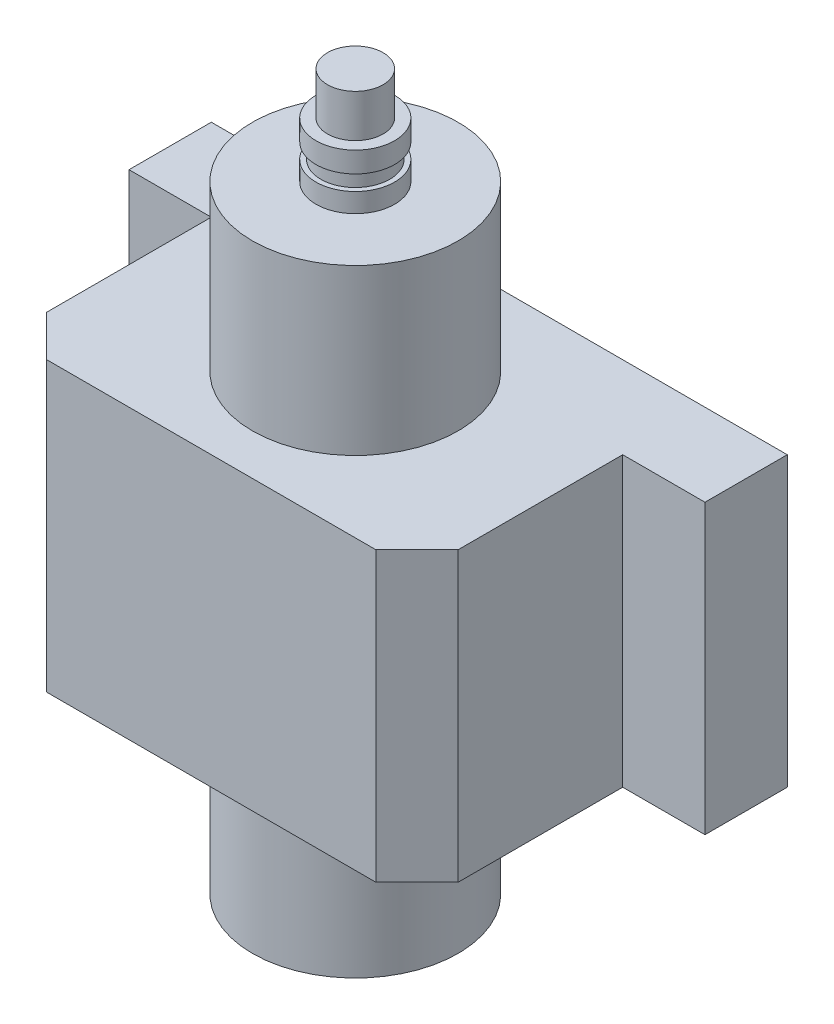
ISO-10303-21;
HEADER;
FILE_DESCRIPTION(('STEP AP214'),'2;1');
FILE_NAME('part.step','',(''),(''),'','','');
FILE_SCHEMA(('AUTOMOTIVE_DESIGN { 1 0 10303 214 1 1 1 1 }'));
ENDSEC;
DATA;
#1=APPLICATION_CONTEXT('core data for automotive mechanical design processes');
#2=APPLICATION_PROTOCOL_DEFINITION('international standard','automotive_design',2000,#1);
#3=PRODUCT_CONTEXT('',#1,'mechanical');
#4=PRODUCT('Part','Part','',(#3));
#5=PRODUCT_RELATED_PRODUCT_CATEGORY('part','',(#4));
#6=PRODUCT_DEFINITION_FORMATION('','',#4);
#7=PRODUCT_DEFINITION_CONTEXT('part definition',#1,'design');
#8=PRODUCT_DEFINITION('design','',#6,#7);
#9=PRODUCT_DEFINITION_SHAPE('','',#8);
#10=(LENGTH_UNIT() NAMED_UNIT(*) SI_UNIT(.MILLI.,.METRE.));
#11=(NAMED_UNIT(*) PLANE_ANGLE_UNIT() SI_UNIT($,.RADIAN.));
#12=(NAMED_UNIT(*) SI_UNIT($,.STERADIAN.) SOLID_ANGLE_UNIT());
#13=UNCERTAINTY_MEASURE_WITH_UNIT(LENGTH_MEASURE(1.E-05),#10,'distance_accuracy_value','');
#14=(GEOMETRIC_REPRESENTATION_CONTEXT(3) GLOBAL_UNCERTAINTY_ASSIGNED_CONTEXT((#13)) GLOBAL_UNIT_ASSIGNED_CONTEXT((#10,
#11,#12)) REPRESENTATION_CONTEXT('',''));
#15=CARTESIAN_POINT('',(0.,0.,0.));
#16=DIRECTION('',(0.,0.,1.));
#17=DIRECTION('',(1.,0.,0.));
#18=AXIS2_PLACEMENT_3D('',#15,#16,#17);
#19=CARTESIAN_POINT('',(0.,70.,0.));
#20=DIRECTION('',(0.,1.,0.));
#21=DIRECTION('',(0.,0.,1.));
#22=AXIS2_PLACEMENT_3D('',#19,#20,#21);
#23=PLANE('',#22);
#24=DIRECTION('',(1.,0.,0.));
#25=VECTOR('',#24,1.);
#26=CARTESIAN_POINT('',(-50.,70.,70.));
#27=LINE('',#26,#25);
#28=CARTESIAN_POINT('',(-40.,70.,70.));
#29=VERTEX_POINT('',#28);
#30=CARTESIAN_POINT('',(39.9999999999999,70.,70.));
#31=VERTEX_POINT('',#30);
#32=EDGE_CURVE('E184',#29,#31,#27,.T.);
#33=ORIENTED_EDGE('',*,*,#32,.T.);
#34=DIRECTION('',(-0.707106781186549,0.,0.707106781186546));
#35=VECTOR('',#34,1.);
#36=CARTESIAN_POINT('',(54.9999999999999,70.,55.0000000000002));
#37=LINE('',#36,#35);
#38=CARTESIAN_POINT('',(50.,70.,60.));
#39=VERTEX_POINT('',#38);
#40=EDGE_CURVE('E53',#31,#39,#37,.F.);
#41=ORIENTED_EDGE('',*,*,#40,.T.);
#42=DIRECTION('',(0.,0.,-1.));
#43=VECTOR('',#42,1.);
#44=CARTESIAN_POINT('',(50.,70.,20.));
#45=LINE('',#44,#43);
#46=CARTESIAN_POINT('',(50.,70.,20.));
#47=VERTEX_POINT('',#46);
#48=EDGE_CURVE('E182',#39,#47,#45,.T.);
#49=ORIENTED_EDGE('',*,*,#48,.T.);
#50=DIRECTION('',(1.,0.,0.));
#51=VECTOR('',#50,1.);
#52=CARTESIAN_POINT('',(70.,70.,20.));
#53=LINE('',#52,#51);
#54=CARTESIAN_POINT('',(70.,70.,20.));
#55=VERTEX_POINT('',#54);
#56=EDGE_CURVE('E193',#47,#55,#53,.T.);
#57=ORIENTED_EDGE('',*,*,#56,.T.);
#58=DIRECTION('',(0.,0.,-1.));
#59=VECTOR('',#58,1.);
#60=CARTESIAN_POINT('',(70.,70.,0.));
#61=LINE('',#60,#59);
#62=CARTESIAN_POINT('',(70.,70.,0.));
#63=VERTEX_POINT('',#62);
#64=EDGE_CURVE('E246',#55,#63,#61,.T.);
#65=ORIENTED_EDGE('',*,*,#64,.T.);
#66=DIRECTION('',(-1.,0.,0.));
#67=VECTOR('',#66,1.);
#68=CARTESIAN_POINT('',(70.,70.,0.));
#69=LINE('',#68,#67);
#70=CARTESIAN_POINT('',(-70.,70.,0.));
#71=VERTEX_POINT('',#70);
#72=EDGE_CURVE('E140',#63,#71,#69,.T.);
#73=ORIENTED_EDGE('',*,*,#72,.T.);
#74=DIRECTION('',(0.,0.,1.));
#75=VECTOR('',#74,1.);
#76=CARTESIAN_POINT('',(-70.,70.,0.));
#77=LINE('',#76,#75);
#78=CARTESIAN_POINT('',(-70.,70.,20.));
#79=VERTEX_POINT('',#78);
#80=EDGE_CURVE('E135',#71,#79,#77,.T.);
#81=ORIENTED_EDGE('',*,*,#80,.T.);
#82=DIRECTION('',(1.,0.,0.));
#83=VECTOR('',#82,1.);
#84=CARTESIAN_POINT('',(-70.,70.,20.));
#85=LINE('',#84,#83);
#86=CARTESIAN_POINT('',(-50.,70.,20.));
#87=VERTEX_POINT('',#86);
#88=EDGE_CURVE('E124',#79,#87,#85,.T.);
#89=ORIENTED_EDGE('',*,*,#88,.T.);
#90=DIRECTION('',(0.,0.,1.));
#91=VECTOR('',#90,1.);
#92=CARTESIAN_POINT('',(-50.,70.,20.));
#93=LINE('',#92,#91);
#94=CARTESIAN_POINT('',(-50.,70.,60.));
#95=VERTEX_POINT('',#94);
#96=EDGE_CURVE('E134',#87,#95,#93,.T.);
#97=ORIENTED_EDGE('',*,*,#96,.T.);
#98=DIRECTION('',(-0.707106781186548,0.,-0.707106781186548));
#99=VECTOR('',#98,1.);
#100=CARTESIAN_POINT('',(-55.,70.,55.));
#101=LINE('',#100,#99);
#102=EDGE_CURVE('E177',#95,#29,#101,.F.);
#103=ORIENTED_EDGE('',*,*,#102,.T.);
#104=EDGE_LOOP('',(#33,#41,#49,#57,#65,#73,#81,#89,#97,#103));
#105=FACE_BOUND('',#104,.T.);
#106=CARTESIAN_POINT('',(0.,70.,35.));
#107=DIRECTION('',(0.,1.,0.));
#108=DIRECTION('',(0.,0.,1.));
#109=AXIS2_PLACEMENT_3D('',#106,#107,#108);
#110=CIRCLE('',#109,25.);
#111=CARTESIAN_POINT('',(0.,70.,60.));
#112=VERTEX_POINT('',#111);
#113=EDGE_CURVE('E253',#112,#112,#110,.T.);
#114=ORIENTED_EDGE('',*,*,#113,.F.);
#115=EDGE_LOOP('',(#114));
#116=FACE_BOUND('',#115,.T.);
#117=ADVANCED_FACE('F43',(#105,#116),#23,.T.);
#118=CARTESIAN_POINT('',(0.,0.,0.));
#119=DIRECTION('',(0.,1.,0.));
#120=DIRECTION('',(0.,0.,1.));
#121=AXIS2_PLACEMENT_3D('',#118,#119,#120);
#122=PLANE('',#121);
#123=DIRECTION('',(0.,0.,-1.));
#124=VECTOR('',#123,1.);
#125=CARTESIAN_POINT('',(50.,0.,20.));
#126=LINE('',#125,#124);
#127=CARTESIAN_POINT('',(50.,0.,60.));
#128=VERTEX_POINT('',#127);
#129=CARTESIAN_POINT('',(50.,0.,20.));
#130=VERTEX_POINT('',#129);
#131=EDGE_CURVE('E202',#128,#130,#126,.T.);
#132=ORIENTED_EDGE('',*,*,#131,.F.);
#133=DIRECTION('',(0.707106781186549,0.,-0.707106781186546));
#134=VECTOR('',#133,1.);
#135=CARTESIAN_POINT('',(50.,0.,60.));
#136=LINE('',#135,#134);
#137=CARTESIAN_POINT('',(39.9999999999999,0.,70.));
#138=VERTEX_POINT('',#137);
#139=EDGE_CURVE('E168',#128,#138,#136,.F.);
#140=ORIENTED_EDGE('',*,*,#139,.T.);
#141=DIRECTION('',(1.,0.,0.));
#142=VECTOR('',#141,1.);
#143=CARTESIAN_POINT('',(-50.,0.,70.));
#144=LINE('',#143,#142);
#145=CARTESIAN_POINT('',(-40.,0.,70.));
#146=VERTEX_POINT('',#145);
#147=EDGE_CURVE('E200',#146,#138,#144,.T.);
#148=ORIENTED_EDGE('',*,*,#147,.F.);
#149=DIRECTION('',(0.707106781186548,0.,0.707106781186548));
#150=VECTOR('',#149,1.);
#151=CARTESIAN_POINT('',(-40.,0.,70.));
#152=LINE('',#151,#150);
#153=CARTESIAN_POINT('',(-50.,0.,60.));
#154=VERTEX_POINT('',#153);
#155=EDGE_CURVE('E165',#146,#154,#152,.F.);
#156=ORIENTED_EDGE('',*,*,#155,.T.);
#157=DIRECTION('',(0.,0.,1.));
#158=VECTOR('',#157,1.);
#159=CARTESIAN_POINT('',(-50.,0.,20.));
#160=LINE('',#159,#158);
#161=CARTESIAN_POINT('',(-50.,0.,20.));
#162=VERTEX_POINT('',#161);
#163=EDGE_CURVE('E206',#162,#154,#160,.T.);
#164=ORIENTED_EDGE('',*,*,#163,.F.);
#165=DIRECTION('',(1.,0.,0.));
#166=VECTOR('',#165,1.);
#167=CARTESIAN_POINT('',(-70.,0.,20.));
#168=LINE('',#167,#166);
#169=CARTESIAN_POINT('',(-70.,0.,20.));
#170=VERTEX_POINT('',#169);
#171=EDGE_CURVE('E212',#170,#162,#168,.T.);
#172=ORIENTED_EDGE('',*,*,#171,.F.);
#173=DIRECTION('',(0.,0.,1.));
#174=VECTOR('',#173,1.);
#175=CARTESIAN_POINT('',(-70.,0.,0.));
#176=LINE('',#175,#174);
#177=CARTESIAN_POINT('',(-70.,0.,0.));
#178=VERTEX_POINT('',#177);
#179=EDGE_CURVE('E149',#178,#170,#176,.T.);
#180=ORIENTED_EDGE('',*,*,#179,.F.);
#181=DIRECTION('',(-1.,0.,0.));
#182=VECTOR('',#181,1.);
#183=CARTESIAN_POINT('',(70.,0.,0.));
#184=LINE('',#183,#182);
#185=CARTESIAN_POINT('',(70.,0.,0.));
#186=VERTEX_POINT('',#185);
#187=EDGE_CURVE('E145',#186,#178,#184,.T.);
#188=ORIENTED_EDGE('',*,*,#187,.F.);
#189=DIRECTION('',(0.,0.,-1.));
#190=VECTOR('',#189,1.);
#191=CARTESIAN_POINT('',(70.,0.,0.));
#192=LINE('',#191,#190);
#193=CARTESIAN_POINT('',(70.,0.,20.));
#194=VERTEX_POINT('',#193);
#195=EDGE_CURVE('E218',#194,#186,#192,.T.);
#196=ORIENTED_EDGE('',*,*,#195,.F.);
#197=DIRECTION('',(1.,0.,0.));
#198=VECTOR('',#197,1.);
#199=CARTESIAN_POINT('',(70.,0.,20.));
#200=LINE('',#199,#198);
#201=EDGE_CURVE('E210',#130,#194,#200,.T.);
#202=ORIENTED_EDGE('',*,*,#201,.F.);
#203=EDGE_LOOP('',(#132,#140,#148,#156,#164,#172,#180,#188,#196,#202));
#204=FACE_BOUND('',#203,.T.);
#205=CARTESIAN_POINT('',(0.,0.,35.));
#206=DIRECTION('',(0.,1.,0.));
#207=DIRECTION('',(0.,0.,1.));
#208=AXIS2_PLACEMENT_3D('',#205,#206,#207);
#209=CIRCLE('',#208,25.);
#210=CARTESIAN_POINT('',(0.,0.,60.));
#211=VERTEX_POINT('',#210);
#212=EDGE_CURVE('E268',#211,#211,#209,.F.);
#213=ORIENTED_EDGE('',*,*,#212,.F.);
#214=EDGE_LOOP('',(#213));
#215=FACE_BOUND('',#214,.T.);
#216=ADVANCED_FACE('F198',(#204,#215),#122,.F.);
#217=CARTESIAN_POINT('',(-70.,70.,0.));
#218=DIRECTION('',(1.,0.,0.));
#219=DIRECTION('',(0.,0.,-1.));
#220=AXIS2_PLACEMENT_3D('',#217,#218,#219);
#221=PLANE('',#220);
#222=ORIENTED_EDGE('',*,*,#179,.T.);
#223=DIRECTION('',(0.,-1.,0.));
#224=VECTOR('',#223,1.);
#225=CARTESIAN_POINT('',(-70.,70.,20.));
#226=LINE('',#225,#224);
#227=EDGE_CURVE('E128',#79,#170,#226,.T.);
#228=ORIENTED_EDGE('',*,*,#227,.F.);
#229=ORIENTED_EDGE('',*,*,#80,.F.);
#230=DIRECTION('',(0.,-1.,0.));
#231=VECTOR('',#230,1.);
#232=CARTESIAN_POINT('',(-70.,70.,0.));
#233=LINE('',#232,#231);
#234=EDGE_CURVE('E223',#71,#178,#233,.T.);
#235=ORIENTED_EDGE('',*,*,#234,.T.);
#236=EDGE_LOOP('',(#222,#228,#229,#235));
#237=FACE_BOUND('',#236,.T.);
#238=ADVANCED_FACE('F147',(#237),#221,.F.);
#239=CARTESIAN_POINT('',(-70.,70.,20.));
#240=DIRECTION('',(0.,0.,-1.));
#241=DIRECTION('',(-1.,0.,0.));
#242=AXIS2_PLACEMENT_3D('',#239,#240,#241);
#243=PLANE('',#242);
#244=ORIENTED_EDGE('',*,*,#171,.T.);
#245=DIRECTION('',(0.,-1.,0.));
#246=VECTOR('',#245,1.);
#247=CARTESIAN_POINT('',(-50.,70.,20.));
#248=LINE('',#247,#246);
#249=EDGE_CURVE('E131',#87,#162,#248,.T.);
#250=ORIENTED_EDGE('',*,*,#249,.F.);
#251=ORIENTED_EDGE('',*,*,#88,.F.);
#252=ORIENTED_EDGE('',*,*,#227,.T.);
#253=EDGE_LOOP('',(#244,#250,#251,#252));
#254=FACE_BOUND('',#253,.T.);
#255=ADVANCED_FACE('F126',(#254),#243,.F.);
#256=CARTESIAN_POINT('',(-50.,70.,20.));
#257=DIRECTION('',(1.,0.,0.));
#258=DIRECTION('',(0.,0.,-1.));
#259=AXIS2_PLACEMENT_3D('',#256,#257,#258);
#260=PLANE('',#259);
#261=ORIENTED_EDGE('',*,*,#163,.T.);
#262=DIRECTION('',(0.,1.,0.));
#263=VECTOR('',#262,1.);
#264=CARTESIAN_POINT('',(-50.,70.,60.));
#265=LINE('',#264,#263);
#266=EDGE_CURVE('E11',#154,#95,#265,.T.);
#267=ORIENTED_EDGE('',*,*,#266,.T.);
#268=ORIENTED_EDGE('',*,*,#96,.F.);
#269=ORIENTED_EDGE('',*,*,#249,.T.);
#270=EDGE_LOOP('',(#261,#267,#268,#269));
#271=FACE_BOUND('',#270,.T.);
#272=ADVANCED_FACE('F256',(#271),#260,.F.);
#273=CARTESIAN_POINT('',(-50.,70.,70.));
#274=DIRECTION('',(0.,0.,-1.));
#275=DIRECTION('',(-1.,0.,0.));
#276=AXIS2_PLACEMENT_3D('',#273,#274,#275);
#277=PLANE('',#276);
#278=ORIENTED_EDGE('',*,*,#147,.T.);
#279=DIRECTION('',(0.,1.,0.));
#280=VECTOR('',#279,1.);
#281=CARTESIAN_POINT('',(39.9999999999999,70.,70.));
#282=LINE('',#281,#280);
#283=EDGE_CURVE('E66',#138,#31,#282,.T.);
#284=ORIENTED_EDGE('',*,*,#283,.T.);
#285=ORIENTED_EDGE('',*,*,#32,.F.);
#286=DIRECTION('',(0.,-1.,0.));
#287=VECTOR('',#286,1.);
#288=CARTESIAN_POINT('',(-40.,70.,70.));
#289=LINE('',#288,#287);
#290=EDGE_CURVE('E171',#29,#146,#289,.T.);
#291=ORIENTED_EDGE('',*,*,#290,.T.);
#292=EDGE_LOOP('',(#278,#284,#285,#291));
#293=FACE_BOUND('',#292,.T.);
#294=ADVANCED_FACE('F203',(#293),#277,.F.);
#295=CARTESIAN_POINT('',(50.,70.,20.));
#296=DIRECTION('',(-1.,0.,0.));
#297=DIRECTION('',(0.,0.,1.));
#298=AXIS2_PLACEMENT_3D('',#295,#296,#297);
#299=PLANE('',#298);
#300=ORIENTED_EDGE('',*,*,#48,.F.);
#301=DIRECTION('',(0.,-1.,0.));
#302=VECTOR('',#301,1.);
#303=CARTESIAN_POINT('',(50.,70.,60.));
#304=LINE('',#303,#302);
#305=EDGE_CURVE('E156',#39,#128,#304,.T.);
#306=ORIENTED_EDGE('',*,*,#305,.T.);
#307=ORIENTED_EDGE('',*,*,#131,.T.);
#308=DIRECTION('',(0.,-1.,0.));
#309=VECTOR('',#308,1.);
#310=CARTESIAN_POINT('',(50.,70.,20.));
#311=LINE('',#310,#309);
#312=EDGE_CURVE('E158',#47,#130,#311,.T.);
#313=ORIENTED_EDGE('',*,*,#312,.F.);
#314=EDGE_LOOP('',(#300,#306,#307,#313));
#315=FACE_BOUND('',#314,.T.);
#316=ADVANCED_FACE('F188',(#315),#299,.F.);
#317=CARTESIAN_POINT('',(70.,70.,20.));
#318=DIRECTION('',(0.,0.,-1.));
#319=DIRECTION('',(-1.,0.,0.));
#320=AXIS2_PLACEMENT_3D('',#317,#318,#319);
#321=PLANE('',#320);
#322=ORIENTED_EDGE('',*,*,#201,.T.);
#323=DIRECTION('',(0.,-1.,0.));
#324=VECTOR('',#323,1.);
#325=CARTESIAN_POINT('',(70.,70.,20.));
#326=LINE('',#325,#324);
#327=EDGE_CURVE('E230',#55,#194,#326,.T.);
#328=ORIENTED_EDGE('',*,*,#327,.F.);
#329=ORIENTED_EDGE('',*,*,#56,.F.);
#330=ORIENTED_EDGE('',*,*,#312,.T.);
#331=EDGE_LOOP('',(#322,#328,#329,#330));
#332=FACE_BOUND('',#331,.T.);
#333=ADVANCED_FACE('F235',(#332),#321,.F.);
#334=CARTESIAN_POINT('',(70.,70.,0.));
#335=DIRECTION('',(-1.,0.,0.));
#336=DIRECTION('',(0.,0.,1.));
#337=AXIS2_PLACEMENT_3D('',#334,#335,#336);
#338=PLANE('',#337);
#339=ORIENTED_EDGE('',*,*,#195,.T.);
#340=DIRECTION('',(0.,-1.,0.));
#341=VECTOR('',#340,1.);
#342=CARTESIAN_POINT('',(70.,70.,0.));
#343=LINE('',#342,#341);
#344=EDGE_CURVE('E226',#63,#186,#343,.T.);
#345=ORIENTED_EDGE('',*,*,#344,.F.);
#346=ORIENTED_EDGE('',*,*,#64,.F.);
#347=ORIENTED_EDGE('',*,*,#327,.T.);
#348=EDGE_LOOP('',(#339,#345,#346,#347));
#349=FACE_BOUND('',#348,.T.);
#350=ADVANCED_FACE('F241',(#349),#338,.F.);
#351=CARTESIAN_POINT('',(70.,70.,0.));
#352=DIRECTION('',(0.,0.,1.));
#353=DIRECTION('',(1.,0.,0.));
#354=AXIS2_PLACEMENT_3D('',#351,#352,#353);
#355=PLANE('',#354);
#356=ORIENTED_EDGE('',*,*,#187,.T.);
#357=ORIENTED_EDGE('',*,*,#234,.F.);
#358=ORIENTED_EDGE('',*,*,#72,.F.);
#359=ORIENTED_EDGE('',*,*,#344,.T.);
#360=EDGE_LOOP('',(#356,#357,#358,#359));
#361=FACE_BOUND('',#360,.T.);
#362=ADVANCED_FACE('F244',(#361),#355,.F.);
#363=CARTESIAN_POINT('',(0.,-40.,35.));
#364=DIRECTION('',(0.,1.,0.));
#365=DIRECTION('',(0.,0.,1.));
#366=AXIS2_PLACEMENT_3D('',#363,#364,#365);
#367=PLANE('',#366);
#368=CARTESIAN_POINT('',(0.,-40.,35.));
#369=DIRECTION('',(0.,1.,0.));
#370=DIRECTION('',(-1.,0.,0.));
#371=AXIS2_PLACEMENT_3D('',#368,#369,#370);
#372=CIRCLE('',#371,9.56401118837471);
#373=CARTESIAN_POINT('',(-9.56401118837472,-40.,35.));
#374=VERTEX_POINT('',#373);
#375=EDGE_CURVE('E312',#374,#374,#372,.T.);
#376=ORIENTED_EDGE('',*,*,#375,.T.);
#377=EDGE_LOOP('',(#376));
#378=FACE_BOUND('',#377,.T.);
#379=CARTESIAN_POINT('',(0.,-40.,35.));
#380=DIRECTION('',(0.,1.,0.));
#381=DIRECTION('',(0.,0.,1.));
#382=AXIS2_PLACEMENT_3D('',#379,#380,#381);
#383=CIRCLE('',#382,25.);
#384=CARTESIAN_POINT('',(0.,-40.,60.));
#385=VERTEX_POINT('',#384);
#386=EDGE_CURVE('E273',#385,#385,#383,.T.);
#387=ORIENTED_EDGE('',*,*,#386,.F.);
#388=EDGE_LOOP('',(#387));
#389=FACE_BOUND('',#388,.T.);
#390=ADVANCED_FACE('F356',(#378,#389),#367,.F.);
#391=CARTESIAN_POINT('',(0.,110.,35.));
#392=DIRECTION('',(0.,-1.,0.));
#393=DIRECTION('',(0.,0.,-1.));
#394=AXIS2_PLACEMENT_3D('',#391,#392,#393);
#395=CYLINDRICAL_SURFACE('',#394,25.);
#396=ORIENTED_EDGE('',*,*,#386,.T.);
#397=EDGE_LOOP('',(#396));
#398=FACE_BOUND('',#397,.T.);
#399=ORIENTED_EDGE('',*,*,#212,.T.);
#400=EDGE_LOOP('',(#399));
#401=FACE_BOUND('',#400,.T.);
#402=ADVANCED_FACE('F392',(#398,#401),#395,.T.);
#403=ORIENTED_EDGE('',*,*,#113,.T.);
#404=EDGE_LOOP('',(#403));
#405=FACE_BOUND('',#404,.T.);
#406=CARTESIAN_POINT('',(0.,110.,35.));
#407=DIRECTION('',(0.,1.,0.));
#408=DIRECTION('',(0.,0.,1.));
#409=AXIS2_PLACEMENT_3D('',#406,#407,#408);
#410=CIRCLE('',#409,25.);
#411=CARTESIAN_POINT('',(0.,110.,60.));
#412=VERTEX_POINT('',#411);
#413=EDGE_CURVE('E272',#412,#412,#410,.T.);
#414=ORIENTED_EDGE('',*,*,#413,.F.);
#415=EDGE_LOOP('',(#414));
#416=FACE_BOUND('',#415,.T.);
#417=ADVANCED_FACE('F351',(#405,#416),#395,.T.);
#418=CARTESIAN_POINT('',(0.,110.,35.));
#419=DIRECTION('',(0.,1.,0.));
#420=DIRECTION('',(0.,0.,1.));
#421=AXIS2_PLACEMENT_3D('',#418,#419,#420);
#422=PLANE('',#421);
#423=CARTESIAN_POINT('',(0.,110.,35.));
#424=DIRECTION('',(0.,1.,0.));
#425=DIRECTION('',(-1.,0.,0.));
#426=AXIS2_PLACEMENT_3D('',#423,#424,#425);
#427=CIRCLE('',#426,9.56401118837471);
#428=CARTESIAN_POINT('',(-9.56401118837472,110.,35.));
#429=VERTEX_POINT('',#428);
#430=EDGE_CURVE('E151',#429,#429,#427,.T.);
#431=ORIENTED_EDGE('',*,*,#430,.F.);
#432=EDGE_LOOP('',(#431));
#433=FACE_BOUND('',#432,.T.);
#434=ORIENTED_EDGE('',*,*,#413,.T.);
#435=EDGE_LOOP('',(#434));
#436=FACE_BOUND('',#435,.T.);
#437=ADVANCED_FACE('F401',(#433,#436),#422,.T.);
#438=CARTESIAN_POINT('',(0.,133.766089861824,35.));
#439=DIRECTION('',(0.,-1.,0.));
#440=DIRECTION('',(1.,0.,0.));
#441=AXIS2_PLACEMENT_3D('',#438,#439,#440);
#442=PLANE('',#441);
#443=CARTESIAN_POINT('',(0.,133.766089861824,35.));
#444=DIRECTION('',(0.,1.,0.));
#445=DIRECTION('',(-1.,0.,0.));
#446=AXIS2_PLACEMENT_3D('',#443,#444,#445);
#447=CIRCLE('',#446,6.75480339750382);
#448=CARTESIAN_POINT('',(-6.75480339750383,133.766089861824,35.));
#449=VERTEX_POINT('',#448);
#450=EDGE_CURVE('E277',#449,#449,#447,.T.);
#451=ORIENTED_EDGE('',*,*,#450,.T.);
#452=EDGE_LOOP('',(#451));
#453=FACE_BOUND('',#452,.T.);
#454=ADVANCED_FACE('F406',(#453),#442,.F.);
#455=CARTESIAN_POINT('',(0.,-40.,35.));
#456=DIRECTION('',(0.,1.,0.));
#457=DIRECTION('',(-1.,0.,0.));
#458=AXIS2_PLACEMENT_3D('',#455,#456,#457);
#459=CYLINDRICAL_SURFACE('',#458,6.75480339750382);
#460=ORIENTED_EDGE('',*,*,#450,.F.);
#461=EDGE_LOOP('',(#460));
#462=FACE_BOUND('',#461,.T.);
#463=CARTESIAN_POINT('',(0.,123.383600128512,35.));
#464=DIRECTION('',(0.,1.,0.));
#465=DIRECTION('',(-1.,0.,0.));
#466=AXIS2_PLACEMENT_3D('',#463,#464,#465);
#467=CIRCLE('',#466,6.75480339750382);
#468=CARTESIAN_POINT('',(-6.75480339750383,123.383600128512,35.));
#469=VERTEX_POINT('',#468);
#470=EDGE_CURVE('E284',#469,#469,#467,.T.);
#471=ORIENTED_EDGE('',*,*,#470,.T.);
#472=EDGE_LOOP('',(#471));
#473=FACE_BOUND('',#472,.T.);
#474=ADVANCED_FACE('F416',(#462,#473),#459,.T.);
#475=CARTESIAN_POINT('',(0.,123.383600128512,35.));
#476=DIRECTION('',(0.,-1.,0.));
#477=DIRECTION('',(1.,0.,0.));
#478=AXIS2_PLACEMENT_3D('',#475,#476,#477);
#479=PLANE('',#478);
#480=ORIENTED_EDGE('',*,*,#470,.F.);
#481=EDGE_LOOP('',(#480));
#482=FACE_BOUND('',#481,.T.);
#483=CARTESIAN_POINT('',(0.,123.383600128512,35.));
#484=DIRECTION('',(0.,1.,0.));
#485=DIRECTION('',(-1.,0.,0.));
#486=AXIS2_PLACEMENT_3D('',#483,#484,#485);
#487=CIRCLE('',#486,9.56401118837471);
#488=CARTESIAN_POINT('',(-9.56401118837472,123.383600128512,35.));
#489=VERTEX_POINT('',#488);
#490=EDGE_CURVE('E288',#489,#489,#487,.T.);
#491=ORIENTED_EDGE('',*,*,#490,.T.);
#492=EDGE_LOOP('',(#491));
#493=FACE_BOUND('',#492,.T.);
#494=ADVANCED_FACE('F423',(#482,#493),#479,.F.);
#495=CARTESIAN_POINT('',(0.,-40.,35.));
#496=DIRECTION('',(0.,1.,0.));
#497=DIRECTION('',(-1.,0.,0.));
#498=AXIS2_PLACEMENT_3D('',#495,#496,#497);
#499=CYLINDRICAL_SURFACE('',#498,9.56401118837471);
#500=ORIENTED_EDGE('',*,*,#490,.F.);
#501=EDGE_LOOP('',(#500));
#502=FACE_BOUND('',#501,.T.);
#503=CARTESIAN_POINT('',(0.,118.357377814233,35.));
#504=DIRECTION('',(0.,1.,0.));
#505=DIRECTION('',(-1.,0.,0.));
#506=AXIS2_PLACEMENT_3D('',#503,#504,#505);
#507=CIRCLE('',#506,9.56401118837471);
#508=CARTESIAN_POINT('',(-9.56401118837472,118.357377814233,35.));
#509=VERTEX_POINT('',#508);
#510=EDGE_CURVE('E292',#509,#509,#507,.T.);
#511=ORIENTED_EDGE('',*,*,#510,.T.);
#512=EDGE_LOOP('',(#511));
#513=FACE_BOUND('',#512,.T.);
#514=ADVANCED_FACE('F427',(#502,#513),#499,.T.);
#515=CARTESIAN_POINT('',(0.,118.357377814233,35.));
#516=DIRECTION('',(0.,1.,0.));
#517=DIRECTION('',(-1.,0.,0.));
#518=AXIS2_PLACEMENT_3D('',#515,#516,#517);
#519=PLANE('',#518);
#520=ORIENTED_EDGE('',*,*,#510,.F.);
#521=EDGE_LOOP('',(#520));
#522=FACE_BOUND('',#521,.T.);
#523=CARTESIAN_POINT('',(0.,118.357377814233,35.));
#524=DIRECTION('',(0.,1.,0.));
#525=DIRECTION('',(-1.,0.,0.));
#526=AXIS2_PLACEMENT_3D('',#523,#524,#525);
#527=CIRCLE('',#526,8.38953728474326);
#528=CARTESIAN_POINT('',(-8.38953728474327,118.357377814233,35.));
#529=VERTEX_POINT('',#528);
#530=EDGE_CURVE('E296',#529,#529,#527,.T.);
#531=ORIENTED_EDGE('',*,*,#530,.T.);
#532=EDGE_LOOP('',(#531));
#533=FACE_BOUND('',#532,.T.);
#534=ADVANCED_FACE('F431',(#522,#533),#519,.F.);
#535=CARTESIAN_POINT('',(0.,-40.,35.));
#536=DIRECTION('',(0.,1.,0.));
#537=DIRECTION('',(-1.,0.,0.));
#538=AXIS2_PLACEMENT_3D('',#535,#536,#537);
#539=CYLINDRICAL_SURFACE('',#538,8.38953728474326);
#540=ORIENTED_EDGE('',*,*,#530,.F.);
#541=EDGE_LOOP('',(#540));
#542=FACE_BOUND('',#541,.T.);
#543=CARTESIAN_POINT('',(0.,114.668590283567,35.));
#544=DIRECTION('',(0.,1.,0.));
#545=DIRECTION('',(-1.,0.,0.));
#546=AXIS2_PLACEMENT_3D('',#543,#544,#545);
#547=CIRCLE('',#546,8.38953728474326);
#548=CARTESIAN_POINT('',(-8.38953728474327,114.668590283567,35.));
#549=VERTEX_POINT('',#548);
#550=EDGE_CURVE('E300',#549,#549,#547,.T.);
#551=ORIENTED_EDGE('',*,*,#550,.T.);
#552=EDGE_LOOP('',(#551));
#553=FACE_BOUND('',#552,.T.);
#554=ADVANCED_FACE('F435',(#542,#553),#539,.T.);
#555=CARTESIAN_POINT('',(0.,114.668590283567,35.));
#556=DIRECTION('',(0.,-1.,0.));
#557=DIRECTION('',(1.,0.,0.));
#558=AXIS2_PLACEMENT_3D('',#555,#556,#557);
#559=PLANE('',#558);
#560=ORIENTED_EDGE('',*,*,#550,.F.);
#561=EDGE_LOOP('',(#560));
#562=FACE_BOUND('',#561,.T.);
#563=CARTESIAN_POINT('',(0.,114.668590283567,35.));
#564=DIRECTION('',(0.,1.,0.));
#565=DIRECTION('',(-1.,0.,0.));
#566=AXIS2_PLACEMENT_3D('',#563,#564,#565);
#567=CIRCLE('',#566,9.56401118837471);
#568=CARTESIAN_POINT('',(-9.56401118837472,114.668590283567,35.));
#569=VERTEX_POINT('',#568);
#570=EDGE_CURVE('E304',#569,#569,#567,.T.);
#571=ORIENTED_EDGE('',*,*,#570,.T.);
#572=EDGE_LOOP('',(#571));
#573=FACE_BOUND('',#572,.T.);
#574=ADVANCED_FACE('F341',(#562,#573),#559,.F.);
#575=CARTESIAN_POINT('',(0.,-40.,35.));
#576=DIRECTION('',(0.,1.,0.));
#577=DIRECTION('',(-1.,0.,0.));
#578=AXIS2_PLACEMENT_3D('',#575,#576,#577);
#579=CYLINDRICAL_SURFACE('',#578,9.56401118837471);
#580=ORIENTED_EDGE('',*,*,#570,.F.);
#581=EDGE_LOOP('',(#580));
#582=FACE_BOUND('',#581,.T.);
#583=ORIENTED_EDGE('',*,*,#430,.T.);
#584=EDGE_LOOP('',(#583));
#585=FACE_BOUND('',#584,.T.);
#586=ADVANCED_FACE('F331',(#582,#585),#579,.T.);
#587=CARTESIAN_POINT('',(0.,-40.,35.));
#588=DIRECTION('',(0.,1.,0.));
#589=DIRECTION('',(-1.,0.,0.));
#590=AXIS2_PLACEMENT_3D('',#587,#588,#589);
#591=CYLINDRICAL_SURFACE('',#590,4.89153466256809);
#592=CARTESIAN_POINT('',(0.,-52.4179388918749,35.));
#593=DIRECTION('',(0.,1.,0.));
#594=DIRECTION('',(-1.,0.,0.));
#595=AXIS2_PLACEMENT_3D('',#592,#593,#594);
#596=CIRCLE('',#595,4.89153466256809);
#597=CARTESIAN_POINT('',(-4.89153466256809,-52.4179388918749,35.));
#598=VERTEX_POINT('',#597);
#599=EDGE_CURVE('E307',#598,#598,#596,.T.);
#600=ORIENTED_EDGE('',*,*,#599,.T.);
#601=EDGE_LOOP('',(#600));
#602=FACE_BOUND('',#601,.T.);
#603=CARTESIAN_POINT('',(0.,-50.7006336948476,35.));
#604=DIRECTION('',(0.,1.,0.));
#605=DIRECTION('',(-1.,0.,0.));
#606=AXIS2_PLACEMENT_3D('',#603,#604,#605);
#607=CIRCLE('',#606,4.89153466256808);
#608=CARTESIAN_POINT('',(-4.89153466256809,-50.7006336948476,35.));
#609=VERTEX_POINT('',#608);
#610=EDGE_CURVE('E320',#609,#609,#607,.T.);
#611=ORIENTED_EDGE('',*,*,#610,.F.);
#612=EDGE_LOOP('',(#611));
#613=FACE_BOUND('',#612,.T.);
#614=ADVANCED_FACE('F328',(#602,#613),#591,.T.);
#615=CARTESIAN_POINT('',(0.,-52.4179388918749,35.));
#616=DIRECTION('',(0.,-1.,0.));
#617=DIRECTION('',(1.,0.,0.));
#618=AXIS2_PLACEMENT_3D('',#615,#616,#617);
#619=PLANE('',#618);
#620=ORIENTED_EDGE('',*,*,#599,.F.);
#621=EDGE_LOOP('',(#620));
#622=FACE_BOUND('',#621,.T.);
#623=ADVANCED_FACE('F330',(#622),#619,.T.);
#624=CARTESIAN_POINT('',(0.,-40.,35.));
#625=DIRECTION('',(0.,1.,0.));
#626=DIRECTION('',(-1.,0.,0.));
#627=AXIS2_PLACEMENT_3D('',#624,#625,#626);
#628=CYLINDRICAL_SURFACE('',#627,9.56401118837471);
#629=CARTESIAN_POINT('',(0.,-50.7006336948476,35.));
#630=DIRECTION('',(0.,1.,0.));
#631=DIRECTION('',(-1.,0.,0.));
#632=AXIS2_PLACEMENT_3D('',#629,#630,#631);
#633=CIRCLE('',#632,9.56401118837471);
#634=CARTESIAN_POINT('',(-9.56401118837472,-50.7006336948476,35.));
#635=VERTEX_POINT('',#634);
#636=EDGE_CURVE('E316',#635,#635,#633,.T.);
#637=ORIENTED_EDGE('',*,*,#636,.T.);
#638=EDGE_LOOP('',(#637));
#639=FACE_BOUND('',#638,.T.);
#640=ORIENTED_EDGE('',*,*,#375,.F.);
#641=EDGE_LOOP('',(#640));
#642=FACE_BOUND('',#641,.T.);
#643=ADVANCED_FACE('F338',(#639,#642),#628,.T.);
#644=CARTESIAN_POINT('',(0.,-50.7006336948476,35.));
#645=DIRECTION('',(0.,-1.,0.));
#646=DIRECTION('',(1.,0.,0.));
#647=AXIS2_PLACEMENT_3D('',#644,#645,#646);
#648=PLANE('',#647);
#649=ORIENTED_EDGE('',*,*,#610,.T.);
#650=EDGE_LOOP('',(#649));
#651=FACE_BOUND('',#650,.T.);
#652=ORIENTED_EDGE('',*,*,#636,.F.);
#653=EDGE_LOOP('',(#652));
#654=FACE_BOUND('',#653,.T.);
#655=ADVANCED_FACE('F325',(#651,#654),#648,.T.);
#656=CARTESIAN_POINT('',(50.,70.,60.));
#657=DIRECTION('',(-0.707106781186545,0.,-0.707106781186549));
#658=DIRECTION('',(0.,-1.,0.));
#659=AXIS2_PLACEMENT_3D('',#656,#657,#658);
#660=PLANE('',#659);
#661=ORIENTED_EDGE('',*,*,#40,.F.);
#662=ORIENTED_EDGE('',*,*,#283,.F.);
#663=ORIENTED_EDGE('',*,*,#139,.F.);
#664=ORIENTED_EDGE('',*,*,#305,.F.);
#665=EDGE_LOOP('',(#661,#662,#663,#664));
#666=FACE_BOUND('',#665,.T.);
#667=ADVANCED_FACE('F195',(#666),#660,.F.);
#668=CARTESIAN_POINT('',(-40.,70.,70.));
#669=DIRECTION('',(0.707106781186547,0.,-0.707106781186547));
#670=DIRECTION('',(0.,-1.,0.));
#671=AXIS2_PLACEMENT_3D('',#668,#669,#670);
#672=PLANE('',#671);
#673=ORIENTED_EDGE('',*,*,#102,.F.);
#674=ORIENTED_EDGE('',*,*,#266,.F.);
#675=ORIENTED_EDGE('',*,*,#155,.F.);
#676=ORIENTED_EDGE('',*,*,#290,.F.);
#677=EDGE_LOOP('',(#673,#674,#675,#676));
#678=FACE_BOUND('',#677,.T.);
#679=ADVANCED_FACE('F46',(#678),#672,.F.);
#680=CLOSED_SHELL('',(#117,#216,#238,#255,#272,#294,#316,#333,#350,#362,#390,#402,#417,#437,
#454,#474,#494,#514,#534,#554,#574,#586,#614,#623,#643,#655,#667,#679));
#681=MANIFOLD_SOLID_BREP('B2',#680);
#682=ADVANCED_BREP_SHAPE_REPRESENTATION('',(#18,#681),#14);
#683=SHAPE_DEFINITION_REPRESENTATION(#9,#682);
ENDSEC;
END-ISO-10303-21;
